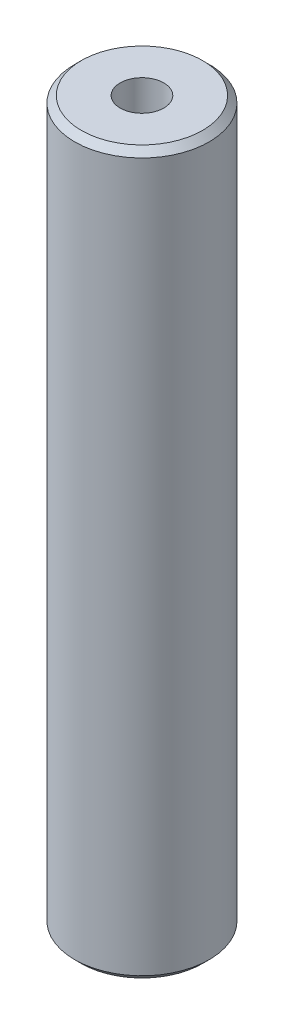
ISO-10303-21;
HEADER;
FILE_DESCRIPTION(('STEP AP214'),'2;1');
FILE_NAME('part.step','',(''),(''),'','','');
FILE_SCHEMA(('AUTOMOTIVE_DESIGN { 1 0 10303 214 1 1 1 1 }'));
ENDSEC;
DATA;
#1=APPLICATION_CONTEXT('core data for automotive mechanical design processes');
#2=APPLICATION_PROTOCOL_DEFINITION('international standard','automotive_design',2000,#1);
#3=PRODUCT_CONTEXT('',#1,'mechanical');
#4=PRODUCT('Part','Part','',(#3));
#5=PRODUCT_RELATED_PRODUCT_CATEGORY('part','',(#4));
#6=PRODUCT_DEFINITION_FORMATION('','',#4);
#7=PRODUCT_DEFINITION_CONTEXT('part definition',#1,'design');
#8=PRODUCT_DEFINITION('design','',#6,#7);
#9=PRODUCT_DEFINITION_SHAPE('','',#8);
#10=(LENGTH_UNIT() NAMED_UNIT(*) SI_UNIT(.MILLI.,.METRE.));
#11=(NAMED_UNIT(*) PLANE_ANGLE_UNIT() SI_UNIT($,.RADIAN.));
#12=(NAMED_UNIT(*) SI_UNIT($,.STERADIAN.) SOLID_ANGLE_UNIT());
#13=UNCERTAINTY_MEASURE_WITH_UNIT(LENGTH_MEASURE(1.E-05),#10,'distance_accuracy_value','');
#14=(GEOMETRIC_REPRESENTATION_CONTEXT(3) GLOBAL_UNCERTAINTY_ASSIGNED_CONTEXT((#13)) GLOBAL_UNIT_ASSIGNED_CONTEXT((#10,
#11,#12)) REPRESENTATION_CONTEXT('',''));
#15=CARTESIAN_POINT('',(0.,0.,0.));
#16=DIRECTION('',(0.,0.,1.));
#17=DIRECTION('',(1.,0.,0.));
#18=AXIS2_PLACEMENT_3D('',#15,#16,#17);
#19=CARTESIAN_POINT('',(0.,483.026783120062,0.));
#20=DIRECTION('',(0.,-1.,0.));
#21=DIRECTION('',(0.,0.,-1.));
#22=AXIS2_PLACEMENT_3D('',#19,#20,#21);
#23=CYLINDRICAL_SURFACE('',#22,45.);
#24=CARTESIAN_POINT('',(0.,478.597239871365,0.));
#25=DIRECTION('',(0.,1.,0.));
#26=DIRECTION('',(0.,0.,1.));
#27=AXIS2_PLACEMENT_3D('',#24,#25,#26);
#28=CIRCLE('',#27,45.);
#29=CARTESIAN_POINT('',(0.,478.597239871365,45.));
#30=VERTEX_POINT('',#29);
#31=EDGE_CURVE('E50',#30,#30,#28,.F.);
#32=ORIENTED_EDGE('',*,*,#31,.T.);
#33=EDGE_LOOP('',(#32));
#34=FACE_BOUND('',#33,.T.);
#35=CARTESIAN_POINT('',(0.,4.42954324869727,0.));
#36=DIRECTION('',(0.,1.,0.));
#37=DIRECTION('',(0.,0.,1.));
#38=AXIS2_PLACEMENT_3D('',#35,#36,#37);
#39=CIRCLE('',#38,45.);
#40=CARTESIAN_POINT('',(0.,4.42954324869727,45.));
#41=VERTEX_POINT('',#40);
#42=EDGE_CURVE('E51',#41,#41,#39,.T.);
#43=ORIENTED_EDGE('',*,*,#42,.T.);
#44=EDGE_LOOP('',(#43));
#45=FACE_BOUND('',#44,.T.);
#46=ADVANCED_FACE('F39',(#34,#45),#23,.T.);
#47=CARTESIAN_POINT('',(0.,483.026783120062,0.));
#48=DIRECTION('',(0.,1.,0.));
#49=DIRECTION('',(0.,0.,1.));
#50=AXIS2_PLACEMENT_3D('',#47,#48,#49);
#51=PLANE('',#50);
#52=CARTESIAN_POINT('',(0.,483.026783120062,0.));
#53=DIRECTION('',(0.,1.,0.));
#54=DIRECTION('',(0.,0.,1.));
#55=AXIS2_PLACEMENT_3D('',#52,#53,#54);
#56=CIRCLE('',#55,40.5704567513027);
#57=CARTESIAN_POINT('',(0.,483.026783120062,40.5704567513027));
#58=VERTEX_POINT('',#57);
#59=EDGE_CURVE('E54',#58,#58,#56,.T.);
#60=ORIENTED_EDGE('',*,*,#59,.T.);
#61=EDGE_LOOP('',(#60));
#62=FACE_BOUND('',#61,.T.);
#63=CARTESIAN_POINT('',(0.,483.026783120062,0.));
#64=DIRECTION('',(0.,1.,0.));
#65=DIRECTION('',(0.,0.,1.));
#66=AXIS2_PLACEMENT_3D('',#63,#64,#65);
#67=CIRCLE('',#66,14.6122746354185);
#68=CARTESIAN_POINT('',(0.,483.026783120062,14.6122746354185));
#69=VERTEX_POINT('',#68);
#70=EDGE_CURVE('E58',#69,#69,#67,.T.);
#71=ORIENTED_EDGE('',*,*,#70,.F.);
#72=EDGE_LOOP('',(#71));
#73=FACE_BOUND('',#72,.T.);
#74=ADVANCED_FACE('F69',(#62,#73),#51,.T.);
#75=CARTESIAN_POINT('',(0.,0.,0.));
#76=DIRECTION('',(0.,1.,0.));
#77=DIRECTION('',(0.,0.,1.));
#78=AXIS2_PLACEMENT_3D('',#75,#76,#77);
#79=PLANE('',#78);
#80=CARTESIAN_POINT('',(0.,0.,0.));
#81=DIRECTION('',(0.,1.,0.));
#82=DIRECTION('',(0.,0.,1.));
#83=AXIS2_PLACEMENT_3D('',#80,#81,#82);
#84=CIRCLE('',#83,40.5704567513027);
#85=CARTESIAN_POINT('',(0.,0.,40.5704567513027));
#86=VERTEX_POINT('',#85);
#87=EDGE_CURVE('E10',#86,#86,#84,.F.);
#88=ORIENTED_EDGE('',*,*,#87,.T.);
#89=EDGE_LOOP('',(#88));
#90=FACE_BOUND('',#89,.T.);
#91=CARTESIAN_POINT('',(0.,0.,0.));
#92=DIRECTION('',(0.,1.,0.));
#93=DIRECTION('',(0.,0.,1.));
#94=AXIS2_PLACEMENT_3D('',#91,#92,#93);
#95=CIRCLE('',#94,14.6122746354185);
#96=CARTESIAN_POINT('',(0.,0.,14.6122746354185));
#97=VERTEX_POINT('',#96);
#98=EDGE_CURVE('E63',#97,#97,#95,.T.);
#99=ORIENTED_EDGE('',*,*,#98,.T.);
#100=EDGE_LOOP('',(#99));
#101=FACE_BOUND('',#100,.T.);
#102=ADVANCED_FACE('F75',(#90,#101),#79,.F.);
#103=CARTESIAN_POINT('',(0.,483.026783120062,0.));
#104=DIRECTION('',(0.,-1.,0.));
#105=DIRECTION('',(0.,0.,-1.));
#106=AXIS2_PLACEMENT_3D('',#103,#104,#105);
#107=CYLINDRICAL_SURFACE('',#106,14.6122746354185);
#108=ORIENTED_EDGE('',*,*,#70,.T.);
#109=EDGE_LOOP('',(#108));
#110=FACE_BOUND('',#109,.T.);
#111=ORIENTED_EDGE('',*,*,#98,.F.);
#112=EDGE_LOOP('',(#111));
#113=FACE_BOUND('',#112,.T.);
#114=ADVANCED_FACE('F70',(#110,#113),#107,.F.);
#115=CARTESIAN_POINT('',(0.,483.026783120062,0.));
#116=DIRECTION('',(0.,-1.,0.));
#117=DIRECTION('',(0.,0.,-1.));
#118=AXIS2_PLACEMENT_3D('',#115,#116,#117);
#119=CONICAL_SURFACE('',#118,40.5704567513027,0.785398163397445);
#120=ORIENTED_EDGE('',*,*,#31,.F.);
#121=EDGE_LOOP('',(#120));
#122=FACE_BOUND('',#121,.T.);
#123=ORIENTED_EDGE('',*,*,#59,.F.);
#124=EDGE_LOOP('',(#123));
#125=FACE_BOUND('',#124,.T.);
#126=ADVANCED_FACE('F81',(#122,#125),#119,.T.);
#127=CARTESIAN_POINT('',(0.,4.42954324869727,0.));
#128=DIRECTION('',(0.,1.,0.));
#129=DIRECTION('',(0.,0.,1.));
#130=AXIS2_PLACEMENT_3D('',#127,#128,#129);
#131=CONICAL_SURFACE('',#130,45.,0.785398163397451);
#132=ORIENTED_EDGE('',*,*,#87,.F.);
#133=EDGE_LOOP('',(#132));
#134=FACE_BOUND('',#133,.T.);
#135=ORIENTED_EDGE('',*,*,#42,.F.);
#136=EDGE_LOOP('',(#135));
#137=FACE_BOUND('',#136,.T.);
#138=ADVANCED_FACE('F45',(#134,#137),#131,.T.);
#139=CLOSED_SHELL('',(#46,#74,#102,#114,#126,#138));
#140=MANIFOLD_SOLID_BREP('B2',#139);
#141=ADVANCED_BREP_SHAPE_REPRESENTATION('',(#18,#140),#14);
#142=SHAPE_DEFINITION_REPRESENTATION(#9,#141);
ENDSEC;
END-ISO-10303-21;
